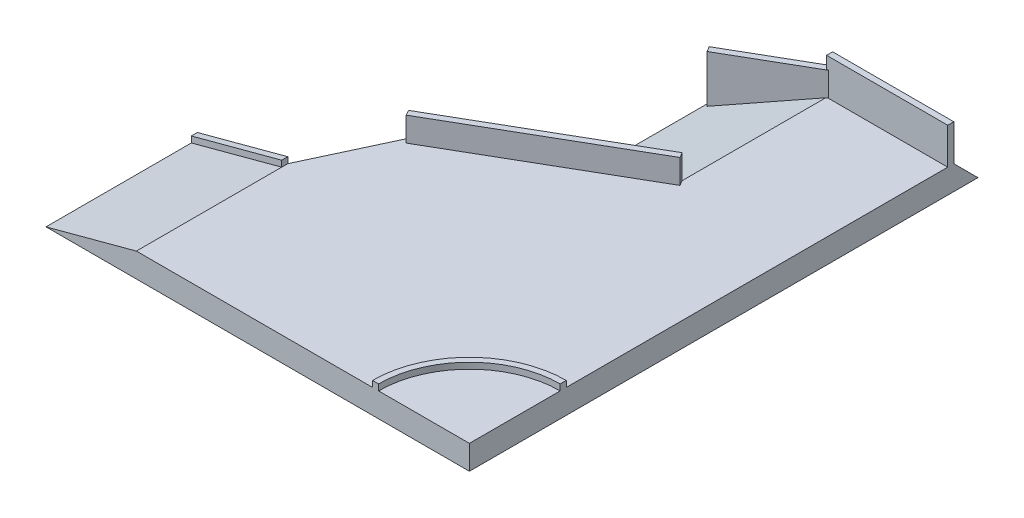
ISO-10303-21;
HEADER;
FILE_DESCRIPTION(('STEP AP214'),'2;1');
FILE_NAME('part.step','',(''),(''),'','','');
FILE_SCHEMA(('AUTOMOTIVE_DESIGN { 1 0 10303 214 1 1 1 1 }'));
ENDSEC;
DATA;
#1=APPLICATION_CONTEXT('core data for automotive mechanical design processes');
#2=APPLICATION_PROTOCOL_DEFINITION('international standard','automotive_design',2000,#1);
#3=PRODUCT_CONTEXT('',#1,'mechanical');
#4=PRODUCT('Part','Part','',(#3));
#5=PRODUCT_RELATED_PRODUCT_CATEGORY('part','',(#4));
#6=PRODUCT_DEFINITION_FORMATION('','',#4);
#7=PRODUCT_DEFINITION_CONTEXT('part definition',#1,'design');
#8=PRODUCT_DEFINITION('design','',#6,#7);
#9=PRODUCT_DEFINITION_SHAPE('','',#8);
#10=(LENGTH_UNIT() NAMED_UNIT(*) SI_UNIT(.MILLI.,.METRE.));
#11=(NAMED_UNIT(*) PLANE_ANGLE_UNIT() SI_UNIT($,.RADIAN.));
#12=(NAMED_UNIT(*) SI_UNIT($,.STERADIAN.) SOLID_ANGLE_UNIT());
#13=UNCERTAINTY_MEASURE_WITH_UNIT(LENGTH_MEASURE(1.E-05),#10,'distance_accuracy_value','');
#14=(GEOMETRIC_REPRESENTATION_CONTEXT(3) GLOBAL_UNCERTAINTY_ASSIGNED_CONTEXT((#13)) GLOBAL_UNIT_ASSIGNED_CONTEXT((#10,
#11,#12)) REPRESENTATION_CONTEXT('',''));
#15=CARTESIAN_POINT('',(0.,0.,0.));
#16=DIRECTION('',(0.,0.,1.));
#17=DIRECTION('',(1.,0.,0.));
#18=AXIS2_PLACEMENT_3D('',#15,#16,#17);
#19=CARTESIAN_POINT('',(750.000000000009,400.,-1514.18947194801));
#20=DIRECTION('',(1.,0.,0.));
#21=DIRECTION('',(0.,0.,-1.));
#22=AXIS2_PLACEMENT_3D('',#19,#20,#21);
#23=PLANE('',#22);
#24=DIRECTION('',(0.,0.,-1.));
#25=VECTOR('',#24,1.);
#26=CARTESIAN_POINT('',(750.000000000009,800.,-1514.18947194801));
#27=LINE('',#26,#25);
#28=CARTESIAN_POINT('',(750.,800.,-3900.));
#29=VERTEX_POINT('',#28);
#30=CARTESIAN_POINT('',(750.,800.,-4000.));
#31=VERTEX_POINT('',#30);
#32=EDGE_CURVE('E242',#29,#31,#27,.T.);
#33=ORIENTED_EDGE('',*,*,#32,.F.);
#34=DIRECTION('',(0.,-1.,0.));
#35=VECTOR('',#34,1.);
#36=CARTESIAN_POINT('',(750.,1000.,-3900.));
#37=LINE('',#36,#35);
#38=CARTESIAN_POINT('',(750.,1000.,-3900.));
#39=VERTEX_POINT('',#38);
#40=EDGE_CURVE('E359',#39,#29,#37,.T.);
#41=ORIENTED_EDGE('',*,*,#40,.F.);
#42=DIRECTION('',(0.,0.,1.));
#43=VECTOR('',#42,1.);
#44=CARTESIAN_POINT('',(750.,1000.,-4000.));
#45=LINE('',#44,#43);
#46=CARTESIAN_POINT('',(750.,1000.,-4000.));
#47=VERTEX_POINT('',#46);
#48=EDGE_CURVE('E351',#47,#39,#45,.T.);
#49=ORIENTED_EDGE('',*,*,#48,.F.);
#50=DIRECTION('',(0.,-1.,0.));
#51=VECTOR('',#50,1.);
#52=CARTESIAN_POINT('',(750.,400.,-4000.));
#53=LINE('',#52,#51);
#54=EDGE_CURVE('E416',#47,#31,#53,.T.);
#55=ORIENTED_EDGE('',*,*,#54,.T.);
#56=EDGE_LOOP('',(#33,#41,#49,#55));
#57=FACE_BOUND('',#56,.T.);
#58=ADVANCED_FACE('F36',(#57),#23,.F.);
#59=CARTESIAN_POINT('',(0.,400.,0.));
#60=DIRECTION('',(0.,-1.,0.));
#61=DIRECTION('',(0.,0.,-1.));
#62=AXIS2_PLACEMENT_3D('',#59,#60,#61);
#63=PLANE('',#62);
#64=DIRECTION('',(0.866025403784442,0.,-0.499999999999995));
#65=VECTOR('',#64,1.);
#66=CARTESIAN_POINT('',(-1494.55080756887,400.,-2588.63793320241));
#67=LINE('',#66,#65);
#68=CARTESIAN_POINT('',(750.000000000008,400.000000000003,-3884.52994616208));
#69=VERTEX_POINT('',#68);
#70=CARTESIAN_POINT('',(776.794919243109,400.,-3900.));
#71=VERTEX_POINT('',#70);
#72=EDGE_CURVE('E239',#69,#71,#67,.T.);
#73=ORIENTED_EDGE('',*,*,#72,.F.);
#74=DIRECTION('',(0.,0.,1.));
#75=VECTOR('',#74,1.);
#76=CARTESIAN_POINT('',(750.000000000009,400.,-1514.18947194801));
#77=LINE('',#76,#75);
#78=CARTESIAN_POINT('',(750.000000000009,400.,-1514.18947194801));
#79=VERTEX_POINT('',#78);
#80=EDGE_CURVE('E392',#69,#79,#77,.T.);
#81=ORIENTED_EDGE('',*,*,#80,.T.);
#82=DIRECTION('',(-0.500000000000001,0.,-0.866025403784438));
#83=VECTOR('',#82,1.);
#84=CARTESIAN_POINT('',(750.000000000009,400.,-1514.18947194801));
#85=LINE('',#84,#83);
#86=CARTESIAN_POINT('',(800.000000000009,400.,-1427.58693156957));
#87=VERTEX_POINT('',#86);
#88=EDGE_CURVE('E314',#87,#79,#85,.T.);
#89=ORIENTED_EDGE('',*,*,#88,.F.);
#90=DIRECTION('',(0.866025403784438,0.,-0.500000000000001));
#91=VECTOR('',#90,1.);
#92=CARTESIAN_POINT('',(800.000000000009,400.,-1427.58693156957));
#93=LINE('',#92,#91);
#94=CARTESIAN_POINT('',(-2066.07260738896,400.,227.140859823467));
#95=VERTEX_POINT('',#94);
#96=EDGE_CURVE('E319',#95,#87,#93,.T.);
#97=ORIENTED_EDGE('',*,*,#96,.F.);
#98=DIRECTION('',(0.499999999999998,0.,0.86602540378444));
#99=VECTOR('',#98,1.);
#100=CARTESIAN_POINT('',(-2116.07260738895,400.,140.538319445023));
#101=LINE('',#100,#99);
#102=CARTESIAN_POINT('',(-2116.07260738895,400.,140.538319445023));
#103=VERTEX_POINT('',#102);
#104=EDGE_CURVE('E328',#103,#95,#101,.T.);
#105=ORIENTED_EDGE('',*,*,#104,.F.);
#106=DIRECTION('',(-0.422618261740697,0.,0.906307787036651));
#107=VECTOR('',#106,1.);
#108=CARTESIAN_POINT('',(-2750.,400.,1500.));
#109=LINE('',#108,#107);
#110=CARTESIAN_POINT('',(-2750.,400.,1500.));
#111=VERTEX_POINT('',#110);
#112=EDGE_CURVE('E395',#103,#111,#109,.T.);
#113=ORIENTED_EDGE('',*,*,#112,.T.);
#114=DIRECTION('',(0.,0.,1.));
#115=VECTOR('',#114,1.);
#116=CARTESIAN_POINT('',(-2750.,400.,4000.));
#117=LINE('',#116,#115);
#118=CARTESIAN_POINT('',(-2750.,400.,1600.));
#119=VERTEX_POINT('',#118);
#120=EDGE_CURVE('E397',#111,#119,#117,.T.);
#121=ORIENTED_EDGE('',*,*,#120,.T.);
#122=CARTESIAN_POINT('',(-2750.,400.,4000.));
#123=VERTEX_POINT('',#122);
#124=EDGE_CURVE('E56',#119,#123,#117,.T.);
#125=ORIENTED_EDGE('',*,*,#124,.T.);
#126=DIRECTION('',(1.,0.,0.));
#127=VECTOR('',#126,1.);
#128=CARTESIAN_POINT('',(-2750.,400.,4000.));
#129=LINE('',#128,#127);
#130=CARTESIAN_POINT('',(1150.,400.,4000.));
#131=VERTEX_POINT('',#130);
#132=EDGE_CURVE('E400',#123,#131,#129,.T.);
#133=ORIENTED_EDGE('',*,*,#132,.T.);
#134=CARTESIAN_POINT('',(2750.,400.,4000.));
#135=DIRECTION('',(0.,1.,0.));
#136=DIRECTION('',(0.,0.,1.));
#137=AXIS2_PLACEMENT_3D('',#134,#135,#136);
#138=CIRCLE('',#137,1600.);
#139=CARTESIAN_POINT('',(2750.,400.,2400.));
#140=VERTEX_POINT('',#139);
#141=EDGE_CURVE('E367',#140,#131,#138,.T.);
#142=ORIENTED_EDGE('',*,*,#141,.F.);
#143=DIRECTION('',(0.,0.,-1.));
#144=VECTOR('',#143,1.);
#145=CARTESIAN_POINT('',(2750.,400.,4000.));
#146=LINE('',#145,#144);
#147=CARTESIAN_POINT('',(2750.,400.,-3900.));
#148=VERTEX_POINT('',#147);
#149=EDGE_CURVE('E393',#140,#148,#146,.T.);
#150=ORIENTED_EDGE('',*,*,#149,.T.);
#151=DIRECTION('',(1.,0.,0.));
#152=VECTOR('',#151,1.);
#153=CARTESIAN_POINT('',(2750.,400.,-3900.));
#154=LINE('',#153,#152);
#155=EDGE_CURVE('E344',#71,#148,#154,.T.);
#156=ORIENTED_EDGE('',*,*,#155,.F.);
#157=EDGE_LOOP('',(#73,#81,#89,#97,#105,#113,#121,#125,#133,#142,#150,#156));
#158=FACE_BOUND('',#157,.T.);
#159=ADVANCED_FACE('F425',(#158),#63,.F.);
#160=CARTESIAN_POINT('',(2750.,1000.,-3900.));
#161=DIRECTION('',(0.,0.,-1.));
#162=DIRECTION('',(-1.,0.,0.));
#163=AXIS2_PLACEMENT_3D('',#160,#161,#162);
#164=PLANE('',#163);
#165=DIRECTION('',(-1.,0.,0.));
#166=VECTOR('',#165,1.);
#167=CARTESIAN_POINT('',(2750.,800.,-3900.));
#168=LINE('',#167,#166);
#169=CARTESIAN_POINT('',(776.79491924311,800.,-3900.));
#170=VERTEX_POINT('',#169);
#171=EDGE_CURVE('E11',#170,#29,#168,.T.);
#172=ORIENTED_EDGE('',*,*,#171,.F.);
#173=DIRECTION('',(0.,1.,0.));
#174=VECTOR('',#173,1.);
#175=CARTESIAN_POINT('',(776.79491924311,1000.,-3900.));
#176=LINE('',#175,#174);
#177=EDGE_CURVE('E214',#71,#170,#176,.T.);
#178=ORIENTED_EDGE('',*,*,#177,.F.);
#179=ORIENTED_EDGE('',*,*,#155,.T.);
#180=DIRECTION('',(0.,-1.,0.));
#181=VECTOR('',#180,1.);
#182=CARTESIAN_POINT('',(2750.,1000.,-3900.));
#183=LINE('',#182,#181);
#184=CARTESIAN_POINT('',(2750.,1000.,-3900.));
#185=VERTEX_POINT('',#184);
#186=EDGE_CURVE('E355',#185,#148,#183,.T.);
#187=ORIENTED_EDGE('',*,*,#186,.F.);
#188=DIRECTION('',(1.,0.,0.));
#189=VECTOR('',#188,1.);
#190=CARTESIAN_POINT('',(2750.,1000.,-3900.));
#191=LINE('',#190,#189);
#192=EDGE_CURVE('E353',#39,#185,#191,.T.);
#193=ORIENTED_EDGE('',*,*,#192,.F.);
#194=ORIENTED_EDGE('',*,*,#40,.T.);
#195=EDGE_LOOP('',(#172,#178,#179,#187,#193,#194));
#196=FACE_BOUND('',#195,.T.);
#197=ADVANCED_FACE('F474',(#196),#164,.F.);
#198=CARTESIAN_POINT('',(750.000000000016,400.,289.491296759178));
#199=DIRECTION('',(0.295576728215631,-0.95531900312793,0.));
#200=DIRECTION('',(0.955319003127931,0.295576728215631,0.));
#201=AXIS2_PLACEMENT_3D('',#198,#199,#200);
#202=PLANE('',#201);
#203=DIRECTION('',(0.494122229169806,0.152881949755444,0.855844806071308));
#204=VECTOR('',#203,1.);
#205=CARTESIAN_POINT('',(1301.38793557872,570.600020979693,-59.3274348419188));
#206=LINE('',#205,#204);
#207=CARTESIAN_POINT('',(-542.820323027591,0.,-3253.58983848621));
#208=VERTEX_POINT('',#207);
#209=CARTESIAN_POINT('',(-492.820323027592,15.4700538379248,-3166.98729810777));
#210=VERTEX_POINT('',#209);
#211=EDGE_CURVE('E225',#208,#210,#206,.T.);
#212=ORIENTED_EDGE('',*,*,#211,.F.);
#213=DIRECTION('',(0.,0.,-1.));
#214=VECTOR('',#213,1.);
#215=CARTESIAN_POINT('',(-542.820323027575,3.61590972515818E-13,1035.90145827297));
#216=LINE('',#215,#214);
#217=CARTESIAN_POINT('',(-542.820323027591,-1.94289029309402E-12,-1229.65952578588));
#218=VERTEX_POINT('',#217);
#219=EDGE_CURVE('E263',#218,#208,#216,.T.);
#220=ORIENTED_EDGE('',*,*,#219,.F.);
#221=DIRECTION('',(0.934879045258563,0.289252583241951,-0.205752554842696));
#222=VECTOR('',#221,1.);
#223=CARTESIAN_POINT('',(403.055236673307,292.654916650998,-1437.83224498283));
#224=LINE('',#223,#222);
#225=EDGE_CURVE('E268',#218,#79,#224,.T.);
#226=ORIENTED_EDGE('',*,*,#225,.T.);
#227=ORIENTED_EDGE('',*,*,#80,.F.);
#228=DIRECTION('',(0.836516303737812,0.258819045102514,-0.48296291314453));
#229=VECTOR('',#228,1.);
#230=CARTESIAN_POINT('',(-936.331091124145,-121.752655365135,-2910.92623675873));
#231=LINE('',#230,#229);
#232=EDGE_CURVE('E44',#210,#69,#231,.T.);
#233=ORIENTED_EDGE('',*,*,#232,.F.);
#234=EDGE_LOOP('',(#212,#220,#226,#227,#233));
#235=FACE_BOUND('',#234,.T.);
#236=ADVANCED_FACE('F427',(#235),#202,.F.);
#237=CARTESIAN_POINT('',(750.,400.,-4000.));
#238=DIRECTION('',(0.,0.,1.));
#239=DIRECTION('',(1.,0.,0.));
#240=AXIS2_PLACEMENT_3D('',#237,#238,#239);
#241=PLANE('',#240);
#242=DIRECTION('',(1.,0.,0.));
#243=VECTOR('',#242,1.);
#244=CARTESIAN_POINT('',(120.747126011606,400.,-4000.));
#245=LINE('',#244,#243);
#246=CARTESIAN_POINT('',(750.,399.999999999999,-4000.));
#247=VERTEX_POINT('',#246);
#248=CARTESIAN_POINT('',(2750.,400.,-4000.));
#249=VERTEX_POINT('',#248);
#250=EDGE_CURVE('E260',#247,#249,#245,.T.);
#251=ORIENTED_EDGE('',*,*,#250,.F.);
#252=DIRECTION('',(0.,1.,0.));
#253=VECTOR('',#252,1.);
#254=CARTESIAN_POINT('',(750.,0.,-4000.));
#255=LINE('',#254,#253);
#256=EDGE_CURVE('E231',#247,#31,#255,.T.);
#257=ORIENTED_EDGE('',*,*,#256,.T.);
#258=ORIENTED_EDGE('',*,*,#54,.F.);
#259=DIRECTION('',(-1.,0.,0.));
#260=VECTOR('',#259,1.);
#261=CARTESIAN_POINT('',(2750.,1000.,-4000.));
#262=LINE('',#261,#260);
#263=CARTESIAN_POINT('',(2750.,1000.,-4000.));
#264=VERTEX_POINT('',#263);
#265=EDGE_CURVE('E348',#264,#47,#262,.T.);
#266=ORIENTED_EDGE('',*,*,#265,.F.);
#267=DIRECTION('',(0.,-1.,0.));
#268=VECTOR('',#267,1.);
#269=CARTESIAN_POINT('',(2750.,400.,-4000.));
#270=LINE('',#269,#268);
#271=EDGE_CURVE('E419',#264,#249,#270,.T.);
#272=ORIENTED_EDGE('',*,*,#271,.T.);
#273=EDGE_LOOP('',(#251,#257,#258,#266,#272));
#274=FACE_BOUND('',#273,.T.);
#275=ADVANCED_FACE('F480',(#274),#241,.F.);
#276=CARTESIAN_POINT('',(499800.,0.,-290102.721526381));
#277=DIRECTION('',(-0.353553390593271,0.707106781186551,-0.612372435695792));
#278=DIRECTION('',(0.,0.654653670707974,0.755928946018457));
#279=AXIS2_PLACEMENT_3D('',#276,#277,#278);
#280=PLANE('',#279);
#281=DIRECTION('',(-0.86602540378444,0.,0.499999999999998));
#282=VECTOR('',#281,1.);
#283=CARTESIAN_POINT('',(500000.,400.,-289756.311364867));
#284=LINE('',#283,#282);
#285=EDGE_CURVE('E271',#79,#103,#284,.T.);
#286=ORIENTED_EDGE('',*,*,#285,.F.);
#287=ORIENTED_EDGE('',*,*,#225,.F.);
#288=DIRECTION('',(-0.86602540378444,0.,0.499999999999998));
#289=VECTOR('',#288,1.);
#290=CARTESIAN_POINT('',(499800.,0.,-290102.721526381));
#291=LINE('',#290,#289);
#292=CARTESIAN_POINT('',(-2316.07260738896,0.,-205.871842068756));
#293=VERTEX_POINT('',#292);
#294=EDGE_CURVE('E279',#218,#293,#291,.T.);
#295=ORIENTED_EDGE('',*,*,#294,.T.);
#296=DIRECTION('',(-0.353553390593274,-0.707106781186544,-0.612372435695799));
#297=VECTOR('',#296,1.);
#298=CARTESIAN_POINT('',(-2316.07260738896,0.,-205.871842068756));
#299=LINE('',#298,#297);
#300=EDGE_CURVE('E276',#103,#293,#299,.T.);
#301=ORIENTED_EDGE('',*,*,#300,.F.);
#302=EDGE_LOOP('',(#286,#287,#295,#301));
#303=FACE_BOUND('',#302,.T.);
#304=ADVANCED_FACE('F432',(#303),#280,.T.);
#305=CARTESIAN_POINT('',(-4242.82032302759,-1.66533453693773E-13,1500.));
#306=DIRECTION('',(-0.258819045102515,0.96592582628907,0.));
#307=DIRECTION('',(-0.96592582628907,-0.258819045102515,0.));
#308=AXIS2_PLACEMENT_3D('',#305,#306,#307);
#309=PLANE('',#308);
#310=ORIENTED_EDGE('',*,*,#124,.F.);
#311=DIRECTION('',(-0.96592582628907,-0.258819045102515,0.));
#312=VECTOR('',#311,1.);
#313=CARTESIAN_POINT('',(-2750.,400.,1600.));
#314=LINE('',#313,#312);
#315=CARTESIAN_POINT('',(-4242.82032302759,-1.66533453693773E-13,1600.));
#316=VERTEX_POINT('',#315);
#317=EDGE_CURVE('E51',#119,#316,#314,.T.);
#318=ORIENTED_EDGE('',*,*,#317,.T.);
#319=DIRECTION('',(0.,0.,1.));
#320=VECTOR('',#319,1.);
#321=CARTESIAN_POINT('',(-4242.82032302759,-1.66533453693773E-13,1500.));
#322=LINE('',#321,#320);
#323=CARTESIAN_POINT('',(-4242.82032302759,-1.66533453693773E-13,4000.));
#324=VERTEX_POINT('',#323);
#325=EDGE_CURVE('E308',#316,#324,#322,.T.);
#326=ORIENTED_EDGE('',*,*,#325,.T.);
#327=DIRECTION('',(-0.96592582628907,-0.258819045102515,0.));
#328=VECTOR('',#327,1.);
#329=CARTESIAN_POINT('',(-4242.82032302759,-1.66533453693773E-13,4000.));
#330=LINE('',#329,#328);
#331=EDGE_CURVE('E303',#123,#324,#330,.T.);
#332=ORIENTED_EDGE('',*,*,#331,.F.);
#333=EDGE_LOOP('',(#310,#318,#326,#332));
#334=FACE_BOUND('',#333,.T.);
#335=ADVANCED_FACE('F487',(#334),#309,.T.);
#336=CARTESIAN_POINT('',(2750.,400.,4000.));
#337=DIRECTION('',(0.,-1.,0.));
#338=DIRECTION('',(0.,0.,1.));
#339=AXIS2_PLACEMENT_3D('',#336,#337,#338);
#340=CIRCLE('',#339,1500.);
#341=CARTESIAN_POINT('',(1250.,400.,4000.));
#342=VERTEX_POINT('',#341);
#343=CARTESIAN_POINT('',(2750.,400.,2500.));
#344=VERTEX_POINT('',#343);
#345=EDGE_CURVE('E362',#342,#344,#340,.T.);
#346=ORIENTED_EDGE('',*,*,#345,.F.);
#347=CARTESIAN_POINT('',(2750.,400.,4000.));
#348=VERTEX_POINT('',#347);
#349=EDGE_CURVE('E399',#342,#348,#129,.T.);
#350=ORIENTED_EDGE('',*,*,#349,.T.);
#351=EDGE_CURVE('E390',#348,#344,#146,.T.);
#352=ORIENTED_EDGE('',*,*,#351,.T.);
#353=EDGE_LOOP('',(#346,#350,#352));
#354=FACE_BOUND('',#353,.T.);
#355=ADVANCED_FACE('F476',(#354),#63,.F.);
#356=CARTESIAN_POINT('',(2750.,400.,4000.));
#357=DIRECTION('',(-1.,0.,0.));
#358=DIRECTION('',(0.,0.,1.));
#359=AXIS2_PLACEMENT_3D('',#356,#357,#358);
#360=PLANE('',#359);
#361=DIRECTION('',(0.,0.,-1.));
#362=VECTOR('',#361,1.);
#363=CARTESIAN_POINT('',(2750.,0.,4000.));
#364=LINE('',#363,#362);
#365=CARTESIAN_POINT('',(2750.,0.,4000.));
#366=VERTEX_POINT('',#365);
#367=CARTESIAN_POINT('',(2750.,0.,-4400.));
#368=VERTEX_POINT('',#367);
#369=EDGE_CURVE('E389',#366,#368,#364,.T.);
#370=ORIENTED_EDGE('',*,*,#369,.T.);
#371=DIRECTION('',(0.,0.707106781186544,0.707106781186551));
#372=VECTOR('',#371,1.);
#373=CARTESIAN_POINT('',(2750.,0.,-4400.));
#374=LINE('',#373,#372);
#375=EDGE_CURVE('E253',#368,#249,#374,.T.);
#376=ORIENTED_EDGE('',*,*,#375,.T.);
#377=ORIENTED_EDGE('',*,*,#271,.F.);
#378=DIRECTION('',(0.,0.,-1.));
#379=VECTOR('',#378,1.);
#380=CARTESIAN_POINT('',(2750.,1000.,-4000.));
#381=LINE('',#380,#379);
#382=EDGE_CURVE('E345',#185,#264,#381,.T.);
#383=ORIENTED_EDGE('',*,*,#382,.F.);
#384=ORIENTED_EDGE('',*,*,#186,.T.);
#385=ORIENTED_EDGE('',*,*,#149,.F.);
#386=DIRECTION('',(0.,-1.,0.));
#387=VECTOR('',#386,1.);
#388=CARTESIAN_POINT('',(2750.,500.,2400.));
#389=LINE('',#388,#387);
#390=CARTESIAN_POINT('',(2750.,500.,2400.));
#391=VERTEX_POINT('',#390);
#392=EDGE_CURVE('E383',#391,#140,#389,.T.);
#393=ORIENTED_EDGE('',*,*,#392,.F.);
#394=DIRECTION('',(0.,0.,-1.));
#395=VECTOR('',#394,1.);
#396=CARTESIAN_POINT('',(2750.,500.,2500.));
#397=LINE('',#396,#395);
#398=CARTESIAN_POINT('',(2750.,500.,2500.));
#399=VERTEX_POINT('',#398);
#400=EDGE_CURVE('E366',#399,#391,#397,.T.);
#401=ORIENTED_EDGE('',*,*,#400,.F.);
#402=DIRECTION('',(0.,-1.,0.));
#403=VECTOR('',#402,1.);
#404=CARTESIAN_POINT('',(2750.,500.,2500.));
#405=LINE('',#404,#403);
#406=EDGE_CURVE('E386',#399,#344,#405,.T.);
#407=ORIENTED_EDGE('',*,*,#406,.T.);
#408=ORIENTED_EDGE('',*,*,#351,.F.);
#409=DIRECTION('',(0.,-1.,0.));
#410=VECTOR('',#409,1.);
#411=CARTESIAN_POINT('',(2750.,400.,4000.));
#412=LINE('',#411,#410);
#413=EDGE_CURVE('E402',#348,#366,#412,.T.);
#414=ORIENTED_EDGE('',*,*,#413,.T.);
#415=EDGE_LOOP('',(#370,#376,#377,#383,#384,#385,#393,#401,#407,#408,#414));
#416=FACE_BOUND('',#415,.T.);
#417=ADVANCED_FACE('F38',(#416),#360,.F.);
#418=CARTESIAN_POINT('',(-2116.07260738895,400.,140.538319445023));
#419=DIRECTION('',(0.500000000000001,0.,0.866025403784438));
#420=DIRECTION('',(0.866025403784438,0.,-0.500000000000001));
#421=AXIS2_PLACEMENT_3D('',#418,#419,#420);
#422=PLANE('',#421);
#423=DIRECTION('',(0.,-1.,0.));
#424=VECTOR('',#423,1.);
#425=CARTESIAN_POINT('',(750.000000000009,800.,-1514.18947194801));
#426=LINE('',#425,#424);
#427=CARTESIAN_POINT('',(750.000000000009,800.,-1514.18947194801));
#428=VERTEX_POINT('',#427);
#429=EDGE_CURVE('E341',#428,#79,#426,.T.);
#430=ORIENTED_EDGE('',*,*,#429,.T.);
#431=ORIENTED_EDGE('',*,*,#285,.T.);
#432=DIRECTION('',(0.,-1.,0.));
#433=VECTOR('',#432,1.);
#434=CARTESIAN_POINT('',(-2116.07260738895,800.,140.538319445023));
#435=LINE('',#434,#433);
#436=CARTESIAN_POINT('',(-2116.07260738895,800.,140.538319445023));
#437=VERTEX_POINT('',#436);
#438=EDGE_CURVE('E338',#437,#103,#435,.T.);
#439=ORIENTED_EDGE('',*,*,#438,.F.);
#440=DIRECTION('',(-0.866025403784438,0.,0.500000000000001));
#441=VECTOR('',#440,1.);
#442=CARTESIAN_POINT('',(750.000000000009,800.,-1514.18947194801));
#443=LINE('',#442,#441);
#444=EDGE_CURVE('E318',#428,#437,#443,.T.);
#445=ORIENTED_EDGE('',*,*,#444,.F.);
#446=EDGE_LOOP('',(#430,#431,#439,#445));
#447=FACE_BOUND('',#446,.T.);
#448=ADVANCED_FACE('F439',(#447),#422,.F.);
#449=CARTESIAN_POINT('',(-2750.,400.,1500.));
#450=DIRECTION('',(0.906307787036651,0.,0.422618261740697));
#451=DIRECTION('',(0.422618261740697,0.,-0.906307787036651));
#452=AXIS2_PLACEMENT_3D('',#449,#450,#451);
#453=PLANE('',#452);
#454=DIRECTION('',(-0.422618261740697,0.,0.906307787036651));
#455=VECTOR('',#454,1.);
#456=CARTESIAN_POINT('',(-2750.,0.,1500.));
#457=LINE('',#456,#455);
#458=CARTESIAN_POINT('',(-2116.07260738896,0.,140.538319445024));
#459=VERTEX_POINT('',#458);
#460=CARTESIAN_POINT('',(-2750.,0.,1500.));
#461=VERTEX_POINT('',#460);
#462=EDGE_CURVE('E404',#459,#461,#457,.T.);
#463=ORIENTED_EDGE('',*,*,#462,.T.);
#464=DIRECTION('',(0.,-1.,0.));
#465=VECTOR('',#464,1.);
#466=CARTESIAN_POINT('',(-2750.,400.,1500.));
#467=LINE('',#466,#465);
#468=EDGE_CURVE('E410',#111,#461,#467,.T.);
#469=ORIENTED_EDGE('',*,*,#468,.F.);
#470=ORIENTED_EDGE('',*,*,#112,.F.);
#471=DIRECTION('',(0.,-1.,0.));
#472=VECTOR('',#471,1.);
#473=CARTESIAN_POINT('',(-2116.07260738895,400.,140.538319445023));
#474=LINE('',#473,#472);
#475=EDGE_CURVE('E413',#103,#459,#474,.T.);
#476=ORIENTED_EDGE('',*,*,#475,.T.);
#477=EDGE_LOOP('',(#463,#469,#470,#476));
#478=FACE_BOUND('',#477,.T.);
#479=ADVANCED_FACE('F445',(#478),#453,.F.);
#480=CARTESIAN_POINT('',(-2750.,400.,4000.));
#481=DIRECTION('',(0.,0.,-1.));
#482=DIRECTION('',(-1.,0.,0.));
#483=AXIS2_PLACEMENT_3D('',#480,#481,#482);
#484=PLANE('',#483);
#485=DIRECTION('',(1.,0.,0.));
#486=VECTOR('',#485,1.);
#487=CARTESIAN_POINT('',(-2750.,0.,4000.));
#488=LINE('',#487,#486);
#489=EDGE_CURVE('E406',#324,#366,#488,.T.);
#490=ORIENTED_EDGE('',*,*,#489,.T.);
#491=ORIENTED_EDGE('',*,*,#413,.F.);
#492=ORIENTED_EDGE('',*,*,#349,.F.);
#493=DIRECTION('',(0.,-1.,0.));
#494=VECTOR('',#493,1.);
#495=CARTESIAN_POINT('',(1250.,500.,4000.));
#496=LINE('',#495,#494);
#497=CARTESIAN_POINT('',(1250.,500.,4000.));
#498=VERTEX_POINT('',#497);
#499=EDGE_CURVE('E373',#498,#342,#496,.T.);
#500=ORIENTED_EDGE('',*,*,#499,.F.);
#501=DIRECTION('',(1.,0.,0.));
#502=VECTOR('',#501,1.);
#503=CARTESIAN_POINT('',(1150.,500.,4000.));
#504=LINE('',#503,#502);
#505=CARTESIAN_POINT('',(1150.,500.,4000.));
#506=VERTEX_POINT('',#505);
#507=EDGE_CURVE('E371',#506,#498,#504,.T.);
#508=ORIENTED_EDGE('',*,*,#507,.F.);
#509=DIRECTION('',(0.,-1.,0.));
#510=VECTOR('',#509,1.);
#511=CARTESIAN_POINT('',(1150.,500.,4000.));
#512=LINE('',#511,#510);
#513=EDGE_CURVE('E380',#506,#131,#512,.T.);
#514=ORIENTED_EDGE('',*,*,#513,.T.);
#515=ORIENTED_EDGE('',*,*,#132,.F.);
#516=ORIENTED_EDGE('',*,*,#331,.T.);
#517=EDGE_LOOP('',(#490,#491,#492,#500,#508,#514,#515,#516));
#518=FACE_BOUND('',#517,.T.);
#519=ADVANCED_FACE('F549',(#518),#484,.F.);
#520=CARTESIAN_POINT('',(0.,0.,0.));
#521=DIRECTION('',(0.,-1.,0.));
#522=DIRECTION('',(0.,0.,-1.));
#523=AXIS2_PLACEMENT_3D('',#520,#521,#522);
#524=PLANE('',#523);
#525=ORIENTED_EDGE('',*,*,#219,.T.);
#526=DIRECTION('',(0.499999999999996,0.,0.866025403784441));
#527=VECTOR('',#526,1.);
#528=CARTESIAN_POINT('',(-542.820323027591,0.,-3253.58983848621));
#529=LINE('',#528,#527);
#530=CARTESIAN_POINT('',(-742.820323027592,0.,-3599.99999999999));
#531=VERTEX_POINT('',#530);
#532=EDGE_CURVE('E246',#531,#208,#529,.T.);
#533=ORIENTED_EDGE('',*,*,#532,.F.);
#534=DIRECTION('',(0.866025403784442,0.,-0.499999999999995));
#535=VECTOR('',#534,1.);
#536=CARTESIAN_POINT('',(-742.820323027592,0.,-3599.99999999999));
#537=LINE('',#536,#535);
#538=CARTESIAN_POINT('',(642.820323027554,0.,-4400.));
#539=VERTEX_POINT('',#538);
#540=EDGE_CURVE('E251',#531,#539,#537,.T.);
#541=ORIENTED_EDGE('',*,*,#540,.T.);
#542=DIRECTION('',(1.,0.,0.));
#543=VECTOR('',#542,1.);
#544=CARTESIAN_POINT('',(120.747126011606,0.,-4400.));
#545=LINE('',#544,#543);
#546=EDGE_CURVE('E256',#539,#368,#545,.T.);
#547=ORIENTED_EDGE('',*,*,#546,.T.);
#548=ORIENTED_EDGE('',*,*,#369,.F.);
#549=ORIENTED_EDGE('',*,*,#489,.F.);
#550=ORIENTED_EDGE('',*,*,#325,.F.);
#551=CARTESIAN_POINT('',(-4242.82032302759,-1.66533453693773E-13,1500.));
#552=VERTEX_POINT('',#551);
#553=EDGE_CURVE('E311',#552,#316,#322,.T.);
#554=ORIENTED_EDGE('',*,*,#553,.F.);
#555=DIRECTION('',(1.,0.,0.));
#556=VECTOR('',#555,1.);
#557=CARTESIAN_POINT('',(-2750.,0.,1500.));
#558=LINE('',#557,#556);
#559=EDGE_CURVE('E305',#552,#461,#558,.T.);
#560=ORIENTED_EDGE('',*,*,#559,.T.);
#561=ORIENTED_EDGE('',*,*,#462,.F.);
#562=DIRECTION('',(0.499999999999998,0.,0.86602540378444));
#563=VECTOR('',#562,1.);
#564=CARTESIAN_POINT('',(-2116.07260738896,0.,140.538319445024));
#565=LINE('',#564,#563);
#566=EDGE_CURVE('E272',#293,#459,#565,.T.);
#567=ORIENTED_EDGE('',*,*,#566,.F.);
#568=ORIENTED_EDGE('',*,*,#294,.F.);
#569=EDGE_LOOP('',(#525,#533,#541,#547,#548,#549,#550,#554,#560,#561,#567,#568));
#570=FACE_BOUND('',#569,.T.);
#571=ADVANCED_FACE('F505',(#570),#524,.T.);
#572=CARTESIAN_POINT('',(2750.,500.,4000.));
#573=DIRECTION('',(0.,-1.,0.));
#574=DIRECTION('',(0.,0.,-1.));
#575=AXIS2_PLACEMENT_3D('',#572,#573,#574);
#576=CYLINDRICAL_SURFACE('',#575,1500.);
#577=ORIENTED_EDGE('',*,*,#345,.T.);
#578=ORIENTED_EDGE('',*,*,#406,.F.);
#579=CARTESIAN_POINT('',(2750.,500.,4000.));
#580=DIRECTION('',(0.,-1.,0.));
#581=DIRECTION('',(0.,0.,1.));
#582=AXIS2_PLACEMENT_3D('',#579,#580,#581);
#583=CIRCLE('',#582,1500.);
#584=EDGE_CURVE('E363',#498,#399,#583,.T.);
#585=ORIENTED_EDGE('',*,*,#584,.F.);
#586=ORIENTED_EDGE('',*,*,#499,.T.);
#587=EDGE_LOOP('',(#577,#578,#585,#586));
#588=FACE_BOUND('',#587,.T.);
#589=ADVANCED_FACE('F545',(#588),#576,.F.);
#590=CARTESIAN_POINT('',(2750.,500.,4000.));
#591=DIRECTION('',(0.,-1.,0.));
#592=DIRECTION('',(0.,0.,-1.));
#593=AXIS2_PLACEMENT_3D('',#590,#591,#592);
#594=CYLINDRICAL_SURFACE('',#593,1600.);
#595=ORIENTED_EDGE('',*,*,#141,.T.);
#596=ORIENTED_EDGE('',*,*,#513,.F.);
#597=CARTESIAN_POINT('',(2750.,500.,4000.));
#598=DIRECTION('',(0.,1.,0.));
#599=DIRECTION('',(0.,0.,1.));
#600=AXIS2_PLACEMENT_3D('',#597,#598,#599);
#601=CIRCLE('',#600,1600.);
#602=EDGE_CURVE('E369',#391,#506,#601,.T.);
#603=ORIENTED_EDGE('',*,*,#602,.F.);
#604=ORIENTED_EDGE('',*,*,#392,.T.);
#605=EDGE_LOOP('',(#595,#596,#603,#604));
#606=FACE_BOUND('',#605,.T.);
#607=ADVANCED_FACE('F760',(#606),#594,.T.);
#608=CARTESIAN_POINT('',(2750.,500.,4000.));
#609=DIRECTION('',(0.,1.,0.));
#610=DIRECTION('',(0.,0.,1.));
#611=AXIS2_PLACEMENT_3D('',#608,#609,#610);
#612=PLANE('',#611);
#613=ORIENTED_EDGE('',*,*,#584,.T.);
#614=ORIENTED_EDGE('',*,*,#400,.T.);
#615=ORIENTED_EDGE('',*,*,#602,.T.);
#616=ORIENTED_EDGE('',*,*,#507,.T.);
#617=EDGE_LOOP('',(#613,#614,#615,#616));
#618=FACE_BOUND('',#617,.T.);
#619=ADVANCED_FACE('F750',(#618),#612,.T.);
#620=CARTESIAN_POINT('',(0.,1000.,0.));
#621=DIRECTION('',(0.,-1.,0.));
#622=DIRECTION('',(0.,0.,-1.));
#623=AXIS2_PLACEMENT_3D('',#620,#621,#622);
#624=PLANE('',#623);
#625=ORIENTED_EDGE('',*,*,#382,.T.);
#626=ORIENTED_EDGE('',*,*,#265,.T.);
#627=ORIENTED_EDGE('',*,*,#48,.T.);
#628=ORIENTED_EDGE('',*,*,#192,.T.);
#629=EDGE_LOOP('',(#625,#626,#627,#628));
#630=FACE_BOUND('',#629,.T.);
#631=ADVANCED_FACE('F745',(#630),#624,.F.);
#632=CARTESIAN_POINT('',(750.000000000009,800.,-1514.18947194801));
#633=DIRECTION('',(-0.866025403784438,0.,0.500000000000001));
#634=DIRECTION('',(0.500000000000001,0.,0.866025403784438));
#635=AXIS2_PLACEMENT_3D('',#632,#633,#634);
#636=PLANE('',#635);
#637=ORIENTED_EDGE('',*,*,#88,.T.);
#638=ORIENTED_EDGE('',*,*,#429,.F.);
#639=DIRECTION('',(-0.500000000000001,0.,-0.866025403784438));
#640=VECTOR('',#639,1.);
#641=CARTESIAN_POINT('',(750.000000000009,800.,-1514.18947194801));
#642=LINE('',#641,#640);
#643=CARTESIAN_POINT('',(800.000000000009,800.,-1427.58693156957));
#644=VERTEX_POINT('',#643);
#645=EDGE_CURVE('E315',#644,#428,#642,.T.);
#646=ORIENTED_EDGE('',*,*,#645,.F.);
#647=DIRECTION('',(0.,-1.,0.));
#648=VECTOR('',#647,1.);
#649=CARTESIAN_POINT('',(800.000000000009,800.,-1427.58693156957));
#650=LINE('',#649,#648);
#651=EDGE_CURVE('E325',#644,#87,#650,.T.);
#652=ORIENTED_EDGE('',*,*,#651,.T.);
#653=EDGE_LOOP('',(#637,#638,#646,#652));
#654=FACE_BOUND('',#653,.T.);
#655=ADVANCED_FACE('F456',(#654),#636,.F.);
#656=CARTESIAN_POINT('',(-2116.07260738895,800.,140.538319445023));
#657=DIRECTION('',(0.86602540378444,0.,-0.499999999999998));
#658=DIRECTION('',(-0.499999999999998,0.,-0.86602540378444));
#659=AXIS2_PLACEMENT_3D('',#656,#657,#658);
#660=PLANE('',#659);
#661=ORIENTED_EDGE('',*,*,#104,.T.);
#662=DIRECTION('',(0.,-1.,0.));
#663=VECTOR('',#662,1.);
#664=CARTESIAN_POINT('',(-2066.07260738896,800.,227.140859823467));
#665=LINE('',#664,#663);
#666=CARTESIAN_POINT('',(-2066.07260738896,800.,227.140859823467));
#667=VERTEX_POINT('',#666);
#668=EDGE_CURVE('E335',#667,#95,#665,.T.);
#669=ORIENTED_EDGE('',*,*,#668,.F.);
#670=DIRECTION('',(0.499999999999998,0.,0.86602540378444));
#671=VECTOR('',#670,1.);
#672=CARTESIAN_POINT('',(-2116.07260738895,800.,140.538319445023));
#673=LINE('',#672,#671);
#674=EDGE_CURVE('E321',#437,#667,#673,.T.);
#675=ORIENTED_EDGE('',*,*,#674,.F.);
#676=ORIENTED_EDGE('',*,*,#438,.T.);
#677=EDGE_LOOP('',(#661,#669,#675,#676));
#678=FACE_BOUND('',#677,.T.);
#679=ADVANCED_FACE('F449',(#678),#660,.F.);
#680=CARTESIAN_POINT('',(800.000000000009,800.,-1427.58693156957));
#681=DIRECTION('',(-0.500000000000001,0.,-0.866025403784438));
#682=DIRECTION('',(-0.866025403784438,0.,0.500000000000001));
#683=AXIS2_PLACEMENT_3D('',#680,#681,#682);
#684=PLANE('',#683);
#685=ORIENTED_EDGE('',*,*,#96,.T.);
#686=ORIENTED_EDGE('',*,*,#651,.F.);
#687=DIRECTION('',(0.866025403784438,0.,-0.500000000000001));
#688=VECTOR('',#687,1.);
#689=CARTESIAN_POINT('',(800.000000000009,800.,-1427.58693156957));
#690=LINE('',#689,#688);
#691=EDGE_CURVE('E323',#667,#644,#690,.T.);
#692=ORIENTED_EDGE('',*,*,#691,.F.);
#693=ORIENTED_EDGE('',*,*,#668,.T.);
#694=EDGE_LOOP('',(#685,#686,#692,#693));
#695=FACE_BOUND('',#694,.T.);
#696=ADVANCED_FACE('F458',(#695),#684,.F.);
#697=CARTESIAN_POINT('',(0.,800.,0.));
#698=DIRECTION('',(0.,-1.,0.));
#699=DIRECTION('',(0.,0.,-1.));
#700=AXIS2_PLACEMENT_3D('',#697,#698,#699);
#701=PLANE('',#700);
#702=ORIENTED_EDGE('',*,*,#645,.T.);
#703=ORIENTED_EDGE('',*,*,#444,.T.);
#704=ORIENTED_EDGE('',*,*,#674,.T.);
#705=ORIENTED_EDGE('',*,*,#691,.T.);
#706=EDGE_LOOP('',(#702,#703,#704,#705));
#707=FACE_BOUND('',#706,.T.);
#708=ADVANCED_FACE('F452',(#707),#701,.F.);
#709=CARTESIAN_POINT('',(0.,0.,1500.));
#710=DIRECTION('',(0.,0.,-1.));
#711=DIRECTION('',(-1.,0.,0.));
#712=AXIS2_PLACEMENT_3D('',#709,#710,#711);
#713=PLANE('',#712);
#714=ORIENTED_EDGE('',*,*,#559,.F.);
#715=DIRECTION('',(0.,1.,0.));
#716=VECTOR('',#715,1.);
#717=CARTESIAN_POINT('',(-4242.82032302759,-1.66533453693773E-13,1500.));
#718=LINE('',#717,#716);
#719=CARTESIAN_POINT('',(-4242.82032302759,99.9999999999999,1500.));
#720=VERTEX_POINT('',#719);
#721=EDGE_CURVE('E296',#552,#720,#718,.T.);
#722=ORIENTED_EDGE('',*,*,#721,.T.);
#723=DIRECTION('',(0.96592582628907,0.258819045102514,0.));
#724=VECTOR('',#723,1.);
#725=CARTESIAN_POINT('',(-4242.82032302759,99.9999999999999,1500.));
#726=LINE('',#725,#724);
#727=CARTESIAN_POINT('',(-2750.,500.,1500.));
#728=VERTEX_POINT('',#727);
#729=EDGE_CURVE('E285',#720,#728,#726,.T.);
#730=ORIENTED_EDGE('',*,*,#729,.T.);
#731=DIRECTION('',(0.,-1.,0.));
#732=VECTOR('',#731,1.);
#733=CARTESIAN_POINT('',(-2750.,500.,1500.));
#734=LINE('',#733,#732);
#735=EDGE_CURVE('E275',#728,#111,#734,.T.);
#736=ORIENTED_EDGE('',*,*,#735,.T.);
#737=ORIENTED_EDGE('',*,*,#468,.T.);
#738=EDGE_LOOP('',(#714,#722,#730,#736,#737));
#739=FACE_BOUND('',#738,.T.);
#740=ADVANCED_FACE('F465',(#739),#713,.T.);
#741=CARTESIAN_POINT('',(-2750.,500.,1600.));
#742=DIRECTION('',(1.,0.,0.));
#743=DIRECTION('',(0.,0.,-1.));
#744=AXIS2_PLACEMENT_3D('',#741,#742,#743);
#745=PLANE('',#744);
#746=ORIENTED_EDGE('',*,*,#735,.F.);
#747=DIRECTION('',(0.,0.,-1.));
#748=VECTOR('',#747,1.);
#749=CARTESIAN_POINT('',(-2750.,500.,1600.));
#750=LINE('',#749,#748);
#751=CARTESIAN_POINT('',(-2750.,500.,1600.));
#752=VERTEX_POINT('',#751);
#753=EDGE_CURVE('E301',#752,#728,#750,.T.);
#754=ORIENTED_EDGE('',*,*,#753,.F.);
#755=DIRECTION('',(0.,-1.,0.));
#756=VECTOR('',#755,1.);
#757=CARTESIAN_POINT('',(-2750.,500.,1600.));
#758=LINE('',#757,#756);
#759=EDGE_CURVE('E282',#752,#119,#758,.T.);
#760=ORIENTED_EDGE('',*,*,#759,.T.);
#761=ORIENTED_EDGE('',*,*,#120,.F.);
#762=EDGE_LOOP('',(#746,#754,#760,#761));
#763=FACE_BOUND('',#762,.T.);
#764=ADVANCED_FACE('F523',(#763),#745,.T.);
#765=CARTESIAN_POINT('',(-4242.82032302759,99.9999999999999,1600.));
#766=DIRECTION('',(-0.258819045102515,0.96592582628907,0.));
#767=DIRECTION('',(-0.96592582628907,-0.258819045102515,0.));
#768=AXIS2_PLACEMENT_3D('',#765,#766,#767);
#769=PLANE('',#768);
#770=ORIENTED_EDGE('',*,*,#729,.F.);
#771=DIRECTION('',(0.,0.,-1.));
#772=VECTOR('',#771,1.);
#773=CARTESIAN_POINT('',(-4242.82032302759,99.9999999999999,1600.));
#774=LINE('',#773,#772);
#775=CARTESIAN_POINT('',(-4242.82032302759,99.9999999999999,1600.));
#776=VERTEX_POINT('',#775);
#777=EDGE_CURVE('E293',#776,#720,#774,.T.);
#778=ORIENTED_EDGE('',*,*,#777,.F.);
#779=DIRECTION('',(0.96592582628907,0.258819045102514,0.));
#780=VECTOR('',#779,1.);
#781=CARTESIAN_POINT('',(-4242.82032302759,99.9999999999999,1600.));
#782=LINE('',#781,#780);
#783=EDGE_CURVE('E290',#776,#752,#782,.T.);
#784=ORIENTED_EDGE('',*,*,#783,.T.);
#785=ORIENTED_EDGE('',*,*,#753,.T.);
#786=EDGE_LOOP('',(#770,#778,#784,#785));
#787=FACE_BOUND('',#786,.T.);
#788=ADVANCED_FACE('F520',(#787),#769,.T.);
#789=CARTESIAN_POINT('',(-4242.82032302759,-1.66533453693773E-13,1600.));
#790=DIRECTION('',(-1.,0.,0.));
#791=DIRECTION('',(0.,0.,1.));
#792=AXIS2_PLACEMENT_3D('',#789,#790,#791);
#793=PLANE('',#792);
#794=ORIENTED_EDGE('',*,*,#721,.F.);
#795=ORIENTED_EDGE('',*,*,#553,.T.);
#796=DIRECTION('',(0.,1.,0.));
#797=VECTOR('',#796,1.);
#798=CARTESIAN_POINT('',(-4242.82032302759,-1.66533453693773E-13,1600.));
#799=LINE('',#798,#797);
#800=EDGE_CURVE('E287',#316,#776,#799,.T.);
#801=ORIENTED_EDGE('',*,*,#800,.T.);
#802=ORIENTED_EDGE('',*,*,#777,.T.);
#803=EDGE_LOOP('',(#794,#795,#801,#802));
#804=FACE_BOUND('',#803,.T.);
#805=ADVANCED_FACE('F516',(#804),#793,.T.);
#806=CARTESIAN_POINT('',(0.,0.,1600.));
#807=DIRECTION('',(0.,0.,-1.));
#808=DIRECTION('',(-1.,0.,0.));
#809=AXIS2_PLACEMENT_3D('',#806,#807,#808);
#810=PLANE('',#809);
#811=ORIENTED_EDGE('',*,*,#759,.F.);
#812=ORIENTED_EDGE('',*,*,#783,.F.);
#813=ORIENTED_EDGE('',*,*,#800,.F.);
#814=ORIENTED_EDGE('',*,*,#317,.F.);
#815=EDGE_LOOP('',(#811,#812,#813,#814));
#816=FACE_BOUND('',#815,.T.);
#817=ADVANCED_FACE('F509',(#816),#810,.F.);
#818=CARTESIAN_POINT('',(-1647.909332964,0.,951.420896986858));
#819=DIRECTION('',(0.86602540378444,0.,-0.499999999999998));
#820=DIRECTION('',(-0.499999999999998,0.,-0.86602540378444));
#821=AXIS2_PLACEMENT_3D('',#818,#819,#820);
#822=PLANE('',#821);
#823=ORIENTED_EDGE('',*,*,#475,.F.);
#824=ORIENTED_EDGE('',*,*,#300,.T.);
#825=ORIENTED_EDGE('',*,*,#566,.T.);
#826=EDGE_LOOP('',(#823,#824,#825));
#827=FACE_BOUND('',#826,.T.);
#828=ADVANCED_FACE('F507',(#827),#822,.F.);
#829=CARTESIAN_POINT('',(120.747126011606,0.,-4400.));
#830=DIRECTION('',(0.,0.707106781186551,-0.707106781186544));
#831=DIRECTION('',(0.,0.707106781186544,0.707106781186551));
#832=AXIS2_PLACEMENT_3D('',#829,#830,#831);
#833=PLANE('',#832);
#834=ORIENTED_EDGE('',*,*,#546,.F.);
#835=DIRECTION('',(0.186156787897382,0.694746590606863,0.69474659060687));
#836=VECTOR('',#835,1.);
#837=CARTESIAN_POINT('',(624.728215899466,-67.5206630180029,-4467.52066301801));
#838=LINE('',#837,#836);
#839=EDGE_CURVE('E257',#539,#247,#838,.T.);
#840=ORIENTED_EDGE('',*,*,#839,.T.);
#841=ORIENTED_EDGE('',*,*,#250,.T.);
#842=ORIENTED_EDGE('',*,*,#375,.F.);
#843=EDGE_LOOP('',(#834,#840,#841,#842));
#844=FACE_BOUND('',#843,.T.);
#845=ADVANCED_FACE('F496',(#844),#833,.T.);
#846=CARTESIAN_POINT('',(-742.820323027592,0.,-3599.99999999999));
#847=DIRECTION('',(0.353553390593269,-0.707106781186551,0.612372435695794));
#848=DIRECTION('',(0.,-0.654653670707975,-0.755928946018457));
#849=AXIS2_PLACEMENT_3D('',#846,#847,#848);
#850=PLANE('',#849);
#851=DIRECTION('',(0.866025403784442,0.,-0.499999999999995));
#852=VECTOR('',#851,1.);
#853=CARTESIAN_POINT('',(-542.820323027591,400.,-3253.58983848621));
#854=LINE('',#853,#852);
#855=CARTESIAN_POINT('',(-542.820323027591,400.,-3253.58983848621));
#856=VERTEX_POINT('',#855);
#857=EDGE_CURVE('E248',#856,#247,#854,.T.);
#858=ORIENTED_EDGE('',*,*,#857,.T.);
#859=ORIENTED_EDGE('',*,*,#839,.F.);
#860=ORIENTED_EDGE('',*,*,#540,.F.);
#861=DIRECTION('',(-0.353553390593272,-0.707106781186544,-0.612372435695799));
#862=VECTOR('',#861,1.);
#863=CARTESIAN_POINT('',(-742.820323027592,0.,-3599.99999999999));
#864=LINE('',#863,#862);
#865=EDGE_CURVE('E244',#856,#531,#864,.T.);
#866=ORIENTED_EDGE('',*,*,#865,.F.);
#867=EDGE_LOOP('',(#858,#859,#860,#866));
#868=FACE_BOUND('',#867,.T.);
#869=ADVANCED_FACE('F499',(#868),#850,.F.);
#870=CARTESIAN_POINT('',(1001.73048454128,0.,-578.349364905356));
#871=DIRECTION('',(0.866025403784441,0.,-0.499999999999996));
#872=DIRECTION('',(-0.499999999999996,0.,-0.866025403784441));
#873=AXIS2_PLACEMENT_3D('',#870,#871,#872);
#874=PLANE('',#873);
#875=ORIENTED_EDGE('',*,*,#865,.T.);
#876=ORIENTED_EDGE('',*,*,#532,.T.);
#877=ORIENTED_EDGE('',*,*,#211,.T.);
#878=DIRECTION('',(0.,-1.,0.));
#879=VECTOR('',#878,1.);
#880=CARTESIAN_POINT('',(-492.820323027592,0.,-3166.98729810777));
#881=LINE('',#880,#879);
#882=CARTESIAN_POINT('',(-492.820323027592,800.,-3166.98729810777));
#883=VERTEX_POINT('',#882);
#884=EDGE_CURVE('E211',#883,#210,#881,.T.);
#885=ORIENTED_EDGE('',*,*,#884,.F.);
#886=DIRECTION('',(-0.499999999999995,0.,-0.866025403784442));
#887=VECTOR('',#886,1.);
#888=CARTESIAN_POINT('',(-492.820323027592,800.,-3166.98729810777));
#889=LINE('',#888,#887);
#890=CARTESIAN_POINT('',(-542.820323027591,800.,-3253.58983848621));
#891=VERTEX_POINT('',#890);
#892=EDGE_CURVE('E217',#883,#891,#889,.T.);
#893=ORIENTED_EDGE('',*,*,#892,.T.);
#894=DIRECTION('',(0.,-1.,0.));
#895=VECTOR('',#894,1.);
#896=CARTESIAN_POINT('',(-542.820323027591,0.,-3253.58983848621));
#897=LINE('',#896,#895);
#898=EDGE_CURVE('E234',#891,#856,#897,.T.);
#899=ORIENTED_EDGE('',*,*,#898,.T.);
#900=EDGE_LOOP('',(#875,#876,#877,#885,#893,#899));
#901=FACE_BOUND('',#900,.T.);
#902=ADVANCED_FACE('F228',(#901),#874,.F.);
#903=CARTESIAN_POINT('',(-492.820323027592,800.,-3166.98729810777));
#904=DIRECTION('',(0.,-1.,0.));
#905=DIRECTION('',(0.,0.,-1.));
#906=AXIS2_PLACEMENT_3D('',#903,#904,#905);
#907=PLANE('',#906);
#908=ORIENTED_EDGE('',*,*,#171,.T.);
#909=ORIENTED_EDGE('',*,*,#32,.T.);
#910=DIRECTION('',(-0.866025403784442,0.,0.499999999999995));
#911=VECTOR('',#910,1.);
#912=CARTESIAN_POINT('',(-542.820323027591,800.,-3253.58983848621));
#913=LINE('',#912,#911);
#914=EDGE_CURVE('E222',#31,#891,#913,.T.);
#915=ORIENTED_EDGE('',*,*,#914,.T.);
#916=ORIENTED_EDGE('',*,*,#892,.F.);
#917=DIRECTION('',(-0.866025403784442,0.,0.499999999999995));
#918=VECTOR('',#917,1.);
#919=CARTESIAN_POINT('',(-492.820323027592,800.,-3166.98729810777));
#920=LINE('',#919,#918);
#921=EDGE_CURVE('E207',#170,#883,#920,.T.);
#922=ORIENTED_EDGE('',*,*,#921,.F.);
#923=EDGE_LOOP('',(#908,#909,#915,#916,#922));
#924=FACE_BOUND('',#923,.T.);
#925=ADVANCED_FACE('F220',(#924),#907,.F.);
#926=CARTESIAN_POINT('',(-1494.55080756887,0.,-2588.63793320241));
#927=DIRECTION('',(-0.499999999999995,0.,-0.866025403784442));
#928=DIRECTION('',(-0.866025403784442,0.,0.499999999999995));
#929=AXIS2_PLACEMENT_3D('',#926,#927,#928);
#930=PLANE('',#929);
#931=ORIENTED_EDGE('',*,*,#72,.T.);
#932=ORIENTED_EDGE('',*,*,#177,.T.);
#933=ORIENTED_EDGE('',*,*,#921,.T.);
#934=ORIENTED_EDGE('',*,*,#884,.T.);
#935=ORIENTED_EDGE('',*,*,#232,.T.);
#936=EDGE_LOOP('',(#931,#932,#933,#934,#935));
#937=FACE_BOUND('',#936,.T.);
#938=ADVANCED_FACE('F209',(#937),#930,.F.);
#939=CARTESIAN_POINT('',(-1544.55080756887,0.,-2675.24047358086));
#940=DIRECTION('',(-0.499999999999995,0.,-0.866025403784442));
#941=DIRECTION('',(-0.866025403784442,0.,0.499999999999995));
#942=AXIS2_PLACEMENT_3D('',#939,#940,#941);
#943=PLANE('',#942);
#944=ORIENTED_EDGE('',*,*,#857,.F.);
#945=ORIENTED_EDGE('',*,*,#898,.F.);
#946=ORIENTED_EDGE('',*,*,#914,.F.);
#947=ORIENTED_EDGE('',*,*,#256,.F.);
#948=EDGE_LOOP('',(#944,#945,#946,#947));
#949=FACE_BOUND('',#948,.T.);
#950=ADVANCED_FACE('F503',(#949),#943,.T.);
#951=CLOSED_SHELL('',(#58,#159,#197,#236,#275,#304,#335,#355,#417,#448,#479,#519,#571,#589,#607,
#619,#631,#655,#679,#696,#708,#740,#764,#788,#805,#817,#828,#845,#869,#902,#925,#938,#950));
#952=MANIFOLD_SOLID_BREP('B2',#951);
#953=ADVANCED_BREP_SHAPE_REPRESENTATION('',(#18,#952),#14);
#954=SHAPE_DEFINITION_REPRESENTATION(#9,#953);
ENDSEC;
END-ISO-10303-21;
